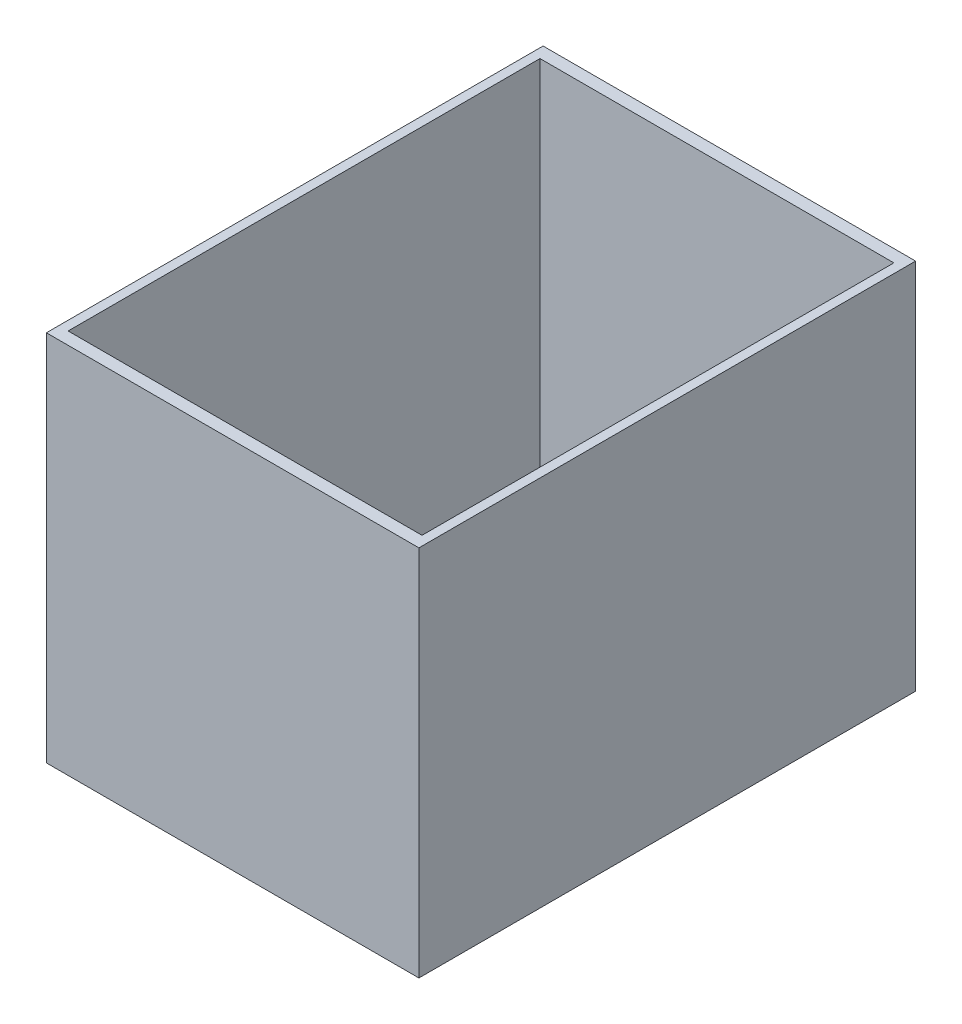
ISO-10303-21;
HEADER;
FILE_DESCRIPTION(('STEP AP214'),'2;1');
FILE_NAME('part.step','',(''),(''),'','','');
FILE_SCHEMA(('AUTOMOTIVE_DESIGN { 1 0 10303 214 1 1 1 1 }'));
ENDSEC;
DATA;
#1=APPLICATION_CONTEXT('core data for automotive mechanical design processes');
#2=APPLICATION_PROTOCOL_DEFINITION('international standard','automotive_design',2000,#1);
#3=PRODUCT_CONTEXT('',#1,'mechanical');
#4=PRODUCT('Part','Part','',(#3));
#5=PRODUCT_RELATED_PRODUCT_CATEGORY('part','',(#4));
#6=PRODUCT_DEFINITION_FORMATION('','',#4);
#7=PRODUCT_DEFINITION_CONTEXT('part definition',#1,'design');
#8=PRODUCT_DEFINITION('design','',#6,#7);
#9=PRODUCT_DEFINITION_SHAPE('','',#8);
#10=(LENGTH_UNIT() NAMED_UNIT(*) SI_UNIT(.MILLI.,.METRE.));
#11=(NAMED_UNIT(*) PLANE_ANGLE_UNIT() SI_UNIT($,.RADIAN.));
#12=(NAMED_UNIT(*) SI_UNIT($,.STERADIAN.) SOLID_ANGLE_UNIT());
#13=UNCERTAINTY_MEASURE_WITH_UNIT(LENGTH_MEASURE(1.E-05),#10,'distance_accuracy_value','');
#14=(GEOMETRIC_REPRESENTATION_CONTEXT(3) GLOBAL_UNCERTAINTY_ASSIGNED_CONTEXT((#13)) GLOBAL_UNIT_ASSIGNED_CONTEXT((#10,
#11,#12)) REPRESENTATION_CONTEXT('',''));
#15=CARTESIAN_POINT('',(0.,0.,0.));
#16=DIRECTION('',(0.,0.,1.));
#17=DIRECTION('',(1.,0.,0.));
#18=AXIS2_PLACEMENT_3D('',#15,#16,#17);
#19=CARTESIAN_POINT('',(0.,30.,0.));
#20=DIRECTION('',(0.,1.,0.));
#21=DIRECTION('',(0.,0.,1.));
#22=AXIS2_PLACEMENT_3D('',#19,#20,#21);
#23=PLANE('',#22);
#24=DIRECTION('',(0.,0.,1.));
#25=VECTOR('',#24,1.);
#26=CARTESIAN_POINT('',(-15.,30.,20.));
#27=LINE('',#26,#25);
#28=CARTESIAN_POINT('',(-15.,30.,-20.));
#29=VERTEX_POINT('',#28);
#30=CARTESIAN_POINT('',(-15.,30.,20.));
#31=VERTEX_POINT('',#30);
#32=EDGE_CURVE('E136',#29,#31,#27,.T.);
#33=ORIENTED_EDGE('',*,*,#32,.T.);
#34=DIRECTION('',(1.,0.,0.));
#35=VECTOR('',#34,1.);
#36=CARTESIAN_POINT('',(15.,30.,20.));
#37=LINE('',#36,#35);
#38=CARTESIAN_POINT('',(15.,30.,20.));
#39=VERTEX_POINT('',#38);
#40=EDGE_CURVE('E139',#31,#39,#37,.T.);
#41=ORIENTED_EDGE('',*,*,#40,.T.);
#42=DIRECTION('',(0.,0.,-1.));
#43=VECTOR('',#42,1.);
#44=CARTESIAN_POINT('',(15.,30.,20.));
#45=LINE('',#44,#43);
#46=CARTESIAN_POINT('',(15.,30.,-20.));
#47=VERTEX_POINT('',#46);
#48=EDGE_CURVE('E142',#39,#47,#45,.T.);
#49=ORIENTED_EDGE('',*,*,#48,.T.);
#50=DIRECTION('',(-1.,0.,0.));
#51=VECTOR('',#50,1.);
#52=CARTESIAN_POINT('',(15.,30.,-20.));
#53=LINE('',#52,#51);
#54=EDGE_CURVE('E144',#47,#29,#53,.T.);
#55=ORIENTED_EDGE('',*,*,#54,.T.);
#56=EDGE_LOOP('',(#33,#41,#49,#55));
#57=FACE_BOUND('',#56,.T.);
#58=DIRECTION('',(1.,0.,0.));
#59=VECTOR('',#58,1.);
#60=CARTESIAN_POINT('',(14.25,30.,19.));
#61=LINE('',#60,#59);
#62=CARTESIAN_POINT('',(-14.25,30.,19.));
#63=VERTEX_POINT('',#62);
#64=CARTESIAN_POINT('',(14.25,30.,19.));
#65=VERTEX_POINT('',#64);
#66=EDGE_CURVE('E108',#63,#65,#61,.T.);
#67=ORIENTED_EDGE('',*,*,#66,.F.);
#68=DIRECTION('',(0.,0.,1.));
#69=VECTOR('',#68,1.);
#70=CARTESIAN_POINT('',(-14.25,30.,19.));
#71=LINE('',#70,#69);
#72=CARTESIAN_POINT('',(-14.25,30.,-19.));
#73=VERTEX_POINT('',#72);
#74=EDGE_CURVE('E100',#73,#63,#71,.T.);
#75=ORIENTED_EDGE('',*,*,#74,.F.);
#76=DIRECTION('',(-1.,0.,0.));
#77=VECTOR('',#76,1.);
#78=CARTESIAN_POINT('',(14.25,30.,-19.));
#79=LINE('',#78,#77);
#80=CARTESIAN_POINT('',(14.25,30.,-19.));
#81=VERTEX_POINT('',#80);
#82=EDGE_CURVE('E122',#81,#73,#79,.T.);
#83=ORIENTED_EDGE('',*,*,#82,.F.);
#84=DIRECTION('',(0.,0.,-1.));
#85=VECTOR('',#84,1.);
#86=CARTESIAN_POINT('',(14.25,30.,19.));
#87=LINE('',#86,#85);
#88=EDGE_CURVE('E120',#65,#81,#87,.T.);
#89=ORIENTED_EDGE('',*,*,#88,.F.);
#90=EDGE_LOOP('',(#67,#75,#83,#89));
#91=FACE_BOUND('',#90,.T.);
#92=ADVANCED_FACE('F35',(#57,#91),#23,.T.);
#93=CARTESIAN_POINT('',(0.,0.,0.));
#94=DIRECTION('',(0.,1.,0.));
#95=DIRECTION('',(0.,0.,1.));
#96=AXIS2_PLACEMENT_3D('',#93,#94,#95);
#97=PLANE('',#96);
#98=DIRECTION('',(0.,0.,1.));
#99=VECTOR('',#98,1.);
#100=CARTESIAN_POINT('',(-15.,0.,20.));
#101=LINE('',#100,#99);
#102=CARTESIAN_POINT('',(-15.,0.,-20.));
#103=VERTEX_POINT('',#102);
#104=CARTESIAN_POINT('',(-15.,0.,20.));
#105=VERTEX_POINT('',#104);
#106=EDGE_CURVE('E116',#103,#105,#101,.T.);
#107=ORIENTED_EDGE('',*,*,#106,.F.);
#108=DIRECTION('',(-1.,0.,0.));
#109=VECTOR('',#108,1.);
#110=CARTESIAN_POINT('',(15.,0.,-20.));
#111=LINE('',#110,#109);
#112=CARTESIAN_POINT('',(15.,0.,-20.));
#113=VERTEX_POINT('',#112);
#114=EDGE_CURVE('E140',#113,#103,#111,.T.);
#115=ORIENTED_EDGE('',*,*,#114,.F.);
#116=DIRECTION('',(0.,0.,-1.));
#117=VECTOR('',#116,1.);
#118=CARTESIAN_POINT('',(15.,0.,20.));
#119=LINE('',#118,#117);
#120=CARTESIAN_POINT('',(15.,0.,20.));
#121=VERTEX_POINT('',#120);
#122=EDGE_CURVE('E151',#121,#113,#119,.T.);
#123=ORIENTED_EDGE('',*,*,#122,.F.);
#124=DIRECTION('',(1.,0.,0.));
#125=VECTOR('',#124,1.);
#126=CARTESIAN_POINT('',(15.,0.,20.));
#127=LINE('',#126,#125);
#128=EDGE_CURVE('E149',#105,#121,#127,.T.);
#129=ORIENTED_EDGE('',*,*,#128,.F.);
#130=EDGE_LOOP('',(#107,#115,#123,#129));
#131=FACE_BOUND('',#130,.T.);
#132=DIRECTION('',(0.,0.,1.));
#133=VECTOR('',#132,1.);
#134=CARTESIAN_POINT('',(-14.25,0.,19.));
#135=LINE('',#134,#133);
#136=CARTESIAN_POINT('',(-14.25,0.,-19.));
#137=VERTEX_POINT('',#136);
#138=CARTESIAN_POINT('',(-14.25,0.,19.));
#139=VERTEX_POINT('',#138);
#140=EDGE_CURVE('E58',#137,#139,#135,.T.);
#141=ORIENTED_EDGE('',*,*,#140,.T.);
#142=DIRECTION('',(1.,0.,0.));
#143=VECTOR('',#142,1.);
#144=CARTESIAN_POINT('',(14.25,0.,19.));
#145=LINE('',#144,#143);
#146=CARTESIAN_POINT('',(14.25,0.,19.));
#147=VERTEX_POINT('',#146);
#148=EDGE_CURVE('E115',#139,#147,#145,.T.);
#149=ORIENTED_EDGE('',*,*,#148,.T.);
#150=DIRECTION('',(0.,0.,-1.));
#151=VECTOR('',#150,1.);
#152=CARTESIAN_POINT('',(14.25,0.,19.));
#153=LINE('',#152,#151);
#154=CARTESIAN_POINT('',(14.25,0.,-19.));
#155=VERTEX_POINT('',#154);
#156=EDGE_CURVE('E128',#147,#155,#153,.T.);
#157=ORIENTED_EDGE('',*,*,#156,.T.);
#158=DIRECTION('',(-1.,0.,0.));
#159=VECTOR('',#158,1.);
#160=CARTESIAN_POINT('',(14.25,0.,-19.));
#161=LINE('',#160,#159);
#162=EDGE_CURVE('E109',#155,#137,#161,.T.);
#163=ORIENTED_EDGE('',*,*,#162,.T.);
#164=EDGE_LOOP('',(#141,#149,#157,#163));
#165=FACE_BOUND('',#164,.T.);
#166=ADVANCED_FACE('F169',(#131,#165),#97,.F.);
#167=CARTESIAN_POINT('',(-15.,30.,20.));
#168=DIRECTION('',(1.,0.,0.));
#169=DIRECTION('',(0.,0.,-1.));
#170=AXIS2_PLACEMENT_3D('',#167,#168,#169);
#171=PLANE('',#170);
#172=ORIENTED_EDGE('',*,*,#106,.T.);
#173=DIRECTION('',(0.,-1.,0.));
#174=VECTOR('',#173,1.);
#175=CARTESIAN_POINT('',(-15.,30.,20.));
#176=LINE('',#175,#174);
#177=EDGE_CURVE('E11',#31,#105,#176,.T.);
#178=ORIENTED_EDGE('',*,*,#177,.F.);
#179=ORIENTED_EDGE('',*,*,#32,.F.);
#180=DIRECTION('',(0.,-1.,0.));
#181=VECTOR('',#180,1.);
#182=CARTESIAN_POINT('',(-15.,30.,-20.));
#183=LINE('',#182,#181);
#184=EDGE_CURVE('E146',#29,#103,#183,.T.);
#185=ORIENTED_EDGE('',*,*,#184,.T.);
#186=EDGE_LOOP('',(#172,#178,#179,#185));
#187=FACE_BOUND('',#186,.T.);
#188=ADVANCED_FACE('F37',(#187),#171,.F.);
#189=CARTESIAN_POINT('',(15.,30.,20.));
#190=DIRECTION('',(0.,0.,-1.));
#191=DIRECTION('',(-1.,0.,0.));
#192=AXIS2_PLACEMENT_3D('',#189,#190,#191);
#193=PLANE('',#192);
#194=ORIENTED_EDGE('',*,*,#128,.T.);
#195=DIRECTION('',(0.,-1.,0.));
#196=VECTOR('',#195,1.);
#197=CARTESIAN_POINT('',(15.,30.,20.));
#198=LINE('',#197,#196);
#199=EDGE_CURVE('E43',#39,#121,#198,.T.);
#200=ORIENTED_EDGE('',*,*,#199,.F.);
#201=ORIENTED_EDGE('',*,*,#40,.F.);
#202=ORIENTED_EDGE('',*,*,#177,.T.);
#203=EDGE_LOOP('',(#194,#200,#201,#202));
#204=FACE_BOUND('',#203,.T.);
#205=ADVANCED_FACE('F179',(#204),#193,.F.);
#206=CARTESIAN_POINT('',(15.,30.,20.));
#207=DIRECTION('',(-1.,0.,0.));
#208=DIRECTION('',(0.,0.,1.));
#209=AXIS2_PLACEMENT_3D('',#206,#207,#208);
#210=PLANE('',#209);
#211=ORIENTED_EDGE('',*,*,#122,.T.);
#212=DIRECTION('',(0.,-1.,0.));
#213=VECTOR('',#212,1.);
#214=CARTESIAN_POINT('',(15.,30.,-20.));
#215=LINE('',#214,#213);
#216=EDGE_CURVE('E156',#47,#113,#215,.T.);
#217=ORIENTED_EDGE('',*,*,#216,.F.);
#218=ORIENTED_EDGE('',*,*,#48,.F.);
#219=ORIENTED_EDGE('',*,*,#199,.T.);
#220=EDGE_LOOP('',(#211,#217,#218,#219));
#221=FACE_BOUND('',#220,.T.);
#222=ADVANCED_FACE('F163',(#221),#210,.F.);
#223=CARTESIAN_POINT('',(15.,30.,-20.));
#224=DIRECTION('',(0.,0.,1.));
#225=DIRECTION('',(1.,0.,0.));
#226=AXIS2_PLACEMENT_3D('',#223,#224,#225);
#227=PLANE('',#226);
#228=ORIENTED_EDGE('',*,*,#114,.T.);
#229=ORIENTED_EDGE('',*,*,#184,.F.);
#230=ORIENTED_EDGE('',*,*,#54,.F.);
#231=ORIENTED_EDGE('',*,*,#216,.T.);
#232=EDGE_LOOP('',(#228,#229,#230,#231));
#233=FACE_BOUND('',#232,.T.);
#234=ADVANCED_FACE('F173',(#233),#227,.F.);
#235=CARTESIAN_POINT('',(-14.25,30.,19.));
#236=DIRECTION('',(1.,0.,0.));
#237=DIRECTION('',(0.,0.,-1.));
#238=AXIS2_PLACEMENT_3D('',#235,#236,#237);
#239=PLANE('',#238);
#240=ORIENTED_EDGE('',*,*,#140,.F.);
#241=DIRECTION('',(0.,-1.,0.));
#242=VECTOR('',#241,1.);
#243=CARTESIAN_POINT('',(-14.25,30.,-19.));
#244=LINE('',#243,#242);
#245=EDGE_CURVE('E104',#73,#137,#244,.T.);
#246=ORIENTED_EDGE('',*,*,#245,.F.);
#247=ORIENTED_EDGE('',*,*,#74,.T.);
#248=DIRECTION('',(0.,-1.,0.));
#249=VECTOR('',#248,1.);
#250=CARTESIAN_POINT('',(-14.25,30.,19.));
#251=LINE('',#250,#249);
#252=EDGE_CURVE('E103',#63,#139,#251,.T.);
#253=ORIENTED_EDGE('',*,*,#252,.T.);
#254=EDGE_LOOP('',(#240,#246,#247,#253));
#255=FACE_BOUND('',#254,.T.);
#256=ADVANCED_FACE('F102',(#255),#239,.T.);
#257=CARTESIAN_POINT('',(14.25,30.,19.));
#258=DIRECTION('',(0.,0.,-1.));
#259=DIRECTION('',(-1.,0.,0.));
#260=AXIS2_PLACEMENT_3D('',#257,#258,#259);
#261=PLANE('',#260);
#262=ORIENTED_EDGE('',*,*,#148,.F.);
#263=ORIENTED_EDGE('',*,*,#252,.F.);
#264=ORIENTED_EDGE('',*,*,#66,.T.);
#265=DIRECTION('',(0.,-1.,0.));
#266=VECTOR('',#265,1.);
#267=CARTESIAN_POINT('',(14.25,30.,19.));
#268=LINE('',#267,#266);
#269=EDGE_CURVE('E117',#65,#147,#268,.T.);
#270=ORIENTED_EDGE('',*,*,#269,.T.);
#271=EDGE_LOOP('',(#262,#263,#264,#270));
#272=FACE_BOUND('',#271,.T.);
#273=ADVANCED_FACE('F112',(#272),#261,.T.);
#274=CARTESIAN_POINT('',(14.25,30.,19.));
#275=DIRECTION('',(-1.,0.,0.));
#276=DIRECTION('',(0.,0.,1.));
#277=AXIS2_PLACEMENT_3D('',#274,#275,#276);
#278=PLANE('',#277);
#279=ORIENTED_EDGE('',*,*,#156,.F.);
#280=ORIENTED_EDGE('',*,*,#269,.F.);
#281=ORIENTED_EDGE('',*,*,#88,.T.);
#282=DIRECTION('',(0.,-1.,0.));
#283=VECTOR('',#282,1.);
#284=CARTESIAN_POINT('',(14.25,30.,-19.));
#285=LINE('',#284,#283);
#286=EDGE_CURVE('E50',#81,#155,#285,.T.);
#287=ORIENTED_EDGE('',*,*,#286,.T.);
#288=EDGE_LOOP('',(#279,#280,#281,#287));
#289=FACE_BOUND('',#288,.T.);
#290=ADVANCED_FACE('F202',(#289),#278,.T.);
#291=CARTESIAN_POINT('',(14.25,30.,-19.));
#292=DIRECTION('',(0.,0.,1.));
#293=DIRECTION('',(1.,0.,0.));
#294=AXIS2_PLACEMENT_3D('',#291,#292,#293);
#295=PLANE('',#294);
#296=ORIENTED_EDGE('',*,*,#162,.F.);
#297=ORIENTED_EDGE('',*,*,#286,.F.);
#298=ORIENTED_EDGE('',*,*,#82,.T.);
#299=ORIENTED_EDGE('',*,*,#245,.T.);
#300=EDGE_LOOP('',(#296,#297,#298,#299));
#301=FACE_BOUND('',#300,.T.);
#302=ADVANCED_FACE('F206',(#301),#295,.T.);
#303=CLOSED_SHELL('',(#92,#166,#188,#205,#222,#234,#256,#273,#290,#302));
#304=MANIFOLD_SOLID_BREP('B2',#303);
#305=ADVANCED_BREP_SHAPE_REPRESENTATION('',(#18,#304),#14);
#306=SHAPE_DEFINITION_REPRESENTATION(#9,#305);
ENDSEC;
END-ISO-10303-21;
